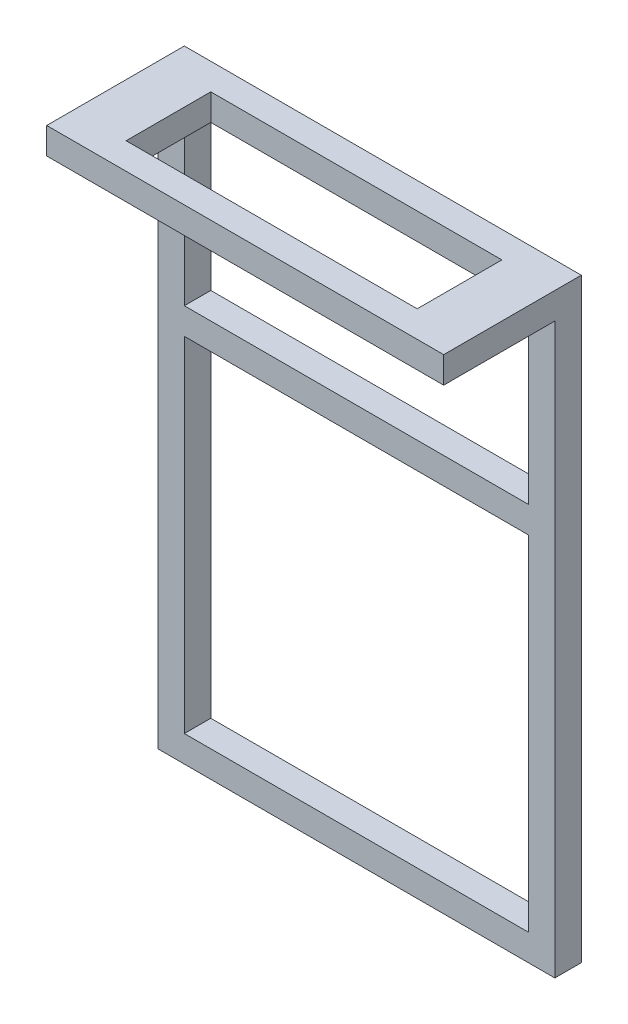
ISO-10303-21;
HEADER;
FILE_DESCRIPTION(('STEP AP214'),'2;1');
FILE_NAME('part.step','',(''),(''),'','','');
FILE_SCHEMA(('AUTOMOTIVE_DESIGN { 1 0 10303 214 1 1 1 1 }'));
ENDSEC;
DATA;
#1=APPLICATION_CONTEXT('core data for automotive mechanical design processes');
#2=APPLICATION_PROTOCOL_DEFINITION('international standard','automotive_design',2000,#1);
#3=PRODUCT_CONTEXT('',#1,'mechanical');
#4=PRODUCT('Part','Part','',(#3));
#5=PRODUCT_RELATED_PRODUCT_CATEGORY('part','',(#4));
#6=PRODUCT_DEFINITION_FORMATION('','',#4);
#7=PRODUCT_DEFINITION_CONTEXT('part definition',#1,'design');
#8=PRODUCT_DEFINITION('design','',#6,#7);
#9=PRODUCT_DEFINITION_SHAPE('','',#8);
#10=(LENGTH_UNIT() NAMED_UNIT(*) SI_UNIT(.MILLI.,.METRE.));
#11=(NAMED_UNIT(*) PLANE_ANGLE_UNIT() SI_UNIT($,.RADIAN.));
#12=(NAMED_UNIT(*) SI_UNIT($,.STERADIAN.) SOLID_ANGLE_UNIT());
#13=UNCERTAINTY_MEASURE_WITH_UNIT(LENGTH_MEASURE(1.E-05),#10,'distance_accuracy_value','');
#14=(GEOMETRIC_REPRESENTATION_CONTEXT(3) GLOBAL_UNCERTAINTY_ASSIGNED_CONTEXT((#13)) GLOBAL_UNIT_ASSIGNED_CONTEXT((#10,
#11,#12)) REPRESENTATION_CONTEXT('',''));
#15=CARTESIAN_POINT('',(0.,0.,0.));
#16=DIRECTION('',(0.,0.,1.));
#17=DIRECTION('',(1.,0.,0.));
#18=AXIS2_PLACEMENT_3D('',#15,#16,#17);
#19=CARTESIAN_POINT('',(4.,0.,2.));
#20=DIRECTION('',(0.,0.,-1.));
#21=DIRECTION('',(-1.,0.,0.));
#22=AXIS2_PLACEMENT_3D('',#19,#20,#21);
#23=PLANE('',#22);
#24=DIRECTION('',(0.,1.,0.));
#25=VECTOR('',#24,1.);
#26=CARTESIAN_POINT('',(4.,0.,2.));
#27=LINE('',#26,#25);
#28=CARTESIAN_POINT('',(4.,0.,2.));
#29=VERTEX_POINT('',#28);
#30=CARTESIAN_POINT('',(4.,2.,2.));
#31=VERTEX_POINT('',#30);
#32=EDGE_CURVE('E292',#29,#31,#27,.T.);
#33=ORIENTED_EDGE('',*,*,#32,.F.);
#34=DIRECTION('',(1.,0.,0.));
#35=VECTOR('',#34,1.);
#36=CARTESIAN_POINT('',(4.,0.,2.));
#37=LINE('',#36,#35);
#38=CARTESIAN_POINT('',(26.,0.,2.));
#39=VERTEX_POINT('',#38);
#40=EDGE_CURVE('E194',#29,#39,#37,.T.);
#41=ORIENTED_EDGE('',*,*,#40,.T.);
#42=DIRECTION('',(0.,1.,0.));
#43=VECTOR('',#42,1.);
#44=CARTESIAN_POINT('',(26.,0.,2.));
#45=LINE('',#44,#43);
#46=CARTESIAN_POINT('',(26.,2.,2.));
#47=VERTEX_POINT('',#46);
#48=EDGE_CURVE('E296',#39,#47,#45,.T.);
#49=ORIENTED_EDGE('',*,*,#48,.T.);
#50=DIRECTION('',(-1.,0.,0.));
#51=VECTOR('',#50,1.);
#52=CARTESIAN_POINT('',(4.,2.,2.));
#53=LINE('',#52,#51);
#54=EDGE_CURVE('E269',#47,#31,#53,.T.);
#55=ORIENTED_EDGE('',*,*,#54,.T.);
#56=EDGE_LOOP('',(#33,#41,#49,#55));
#57=FACE_BOUND('',#56,.T.);
#58=ADVANCED_FACE('F39',(#57),#23,.F.);
#59=CARTESIAN_POINT('',(0.,2.,0.));
#60=DIRECTION('',(0.,0.,1.));
#61=DIRECTION('',(1.,0.,0.));
#62=AXIS2_PLACEMENT_3D('',#59,#60,#61);
#63=PLANE('',#62);
#64=DIRECTION('',(-1.,0.,0.));
#65=VECTOR('',#64,1.);
#66=CARTESIAN_POINT('',(28.,-13.,0.));
#67=LINE('',#66,#65);
#68=CARTESIAN_POINT('',(28.,-13.,0.));
#69=VERTEX_POINT('',#68);
#70=CARTESIAN_POINT('',(2.,-13.,0.));
#71=VERTEX_POINT('',#70);
#72=EDGE_CURVE('E176',#69,#71,#67,.T.);
#73=ORIENTED_EDGE('',*,*,#72,.F.);
#74=DIRECTION('',(0.,-1.,0.));
#75=VECTOR('',#74,1.);
#76=CARTESIAN_POINT('',(28.,0.,0.));
#77=LINE('',#76,#75);
#78=CARTESIAN_POINT('',(28.,0.,0.));
#79=VERTEX_POINT('',#78);
#80=EDGE_CURVE('E55',#79,#69,#77,.T.);
#81=ORIENTED_EDGE('',*,*,#80,.F.);
#82=DIRECTION('',(1.,0.,0.));
#83=VECTOR('',#82,1.);
#84=CARTESIAN_POINT('',(28.,0.,0.));
#85=LINE('',#84,#83);
#86=CARTESIAN_POINT('',(2.,0.,0.));
#87=VERTEX_POINT('',#86);
#88=EDGE_CURVE('E184',#87,#79,#85,.T.);
#89=ORIENTED_EDGE('',*,*,#88,.F.);
#90=DIRECTION('',(0.,1.,0.));
#91=VECTOR('',#90,1.);
#92=CARTESIAN_POINT('',(2.,0.,0.));
#93=LINE('',#92,#91);
#94=EDGE_CURVE('E167',#71,#87,#93,.T.);
#95=ORIENTED_EDGE('',*,*,#94,.F.);
#96=EDGE_LOOP('',(#73,#81,#89,#95));
#97=FACE_BOUND('',#96,.T.);
#98=DIRECTION('',(0.,-1.,0.));
#99=VECTOR('',#98,1.);
#100=CARTESIAN_POINT('',(30.,2.,0.));
#101=LINE('',#100,#99);
#102=CARTESIAN_POINT('',(30.,2.,0.));
#103=VERTEX_POINT('',#102);
#104=CARTESIAN_POINT('',(30.,-43.,0.));
#105=VERTEX_POINT('',#104);
#106=EDGE_CURVE('E329',#103,#105,#101,.T.);
#107=ORIENTED_EDGE('',*,*,#106,.T.);
#108=DIRECTION('',(-1.,0.,0.));
#109=VECTOR('',#108,1.);
#110=CARTESIAN_POINT('',(0.,-43.,0.));
#111=LINE('',#110,#109);
#112=CARTESIAN_POINT('',(0.,-43.,0.));
#113=VERTEX_POINT('',#112);
#114=EDGE_CURVE('E248',#105,#113,#111,.T.);
#115=ORIENTED_EDGE('',*,*,#114,.T.);
#116=DIRECTION('',(0.,-1.,0.));
#117=VECTOR('',#116,1.);
#118=CARTESIAN_POINT('',(0.,2.,0.));
#119=LINE('',#118,#117);
#120=CARTESIAN_POINT('',(0.,2.,0.));
#121=VERTEX_POINT('',#120);
#122=EDGE_CURVE('E318',#121,#113,#119,.T.);
#123=ORIENTED_EDGE('',*,*,#122,.F.);
#124=DIRECTION('',(-1.,0.,0.));
#125=VECTOR('',#124,1.);
#126=CARTESIAN_POINT('',(0.,2.,0.));
#127=LINE('',#126,#125);
#128=EDGE_CURVE('E315',#103,#121,#127,.T.);
#129=ORIENTED_EDGE('',*,*,#128,.F.);
#130=EDGE_LOOP('',(#107,#115,#123,#129));
#131=FACE_BOUND('',#130,.T.);
#132=DIRECTION('',(-1.,0.,0.));
#133=VECTOR('',#132,1.);
#134=CARTESIAN_POINT('',(0.,-15.,0.));
#135=LINE('',#134,#133);
#136=CARTESIAN_POINT('',(28.,-15.,0.));
#137=VERTEX_POINT('',#136);
#138=CARTESIAN_POINT('',(2.,-15.,0.));
#139=VERTEX_POINT('',#138);
#140=EDGE_CURVE('E207',#137,#139,#135,.T.);
#141=ORIENTED_EDGE('',*,*,#140,.T.);
#142=DIRECTION('',(0.,-1.,0.));
#143=VECTOR('',#142,1.);
#144=CARTESIAN_POINT('',(2.,0.,0.));
#145=LINE('',#144,#143);
#146=CARTESIAN_POINT('',(2.,-41.,0.));
#147=VERTEX_POINT('',#146);
#148=EDGE_CURVE('E219',#139,#147,#145,.T.);
#149=ORIENTED_EDGE('',*,*,#148,.T.);
#150=DIRECTION('',(-1.,0.,0.));
#151=VECTOR('',#150,1.);
#152=CARTESIAN_POINT('',(0.,-41.,0.));
#153=LINE('',#152,#151);
#154=CARTESIAN_POINT('',(28.,-41.,0.));
#155=VERTEX_POINT('',#154);
#156=EDGE_CURVE('E215',#155,#147,#153,.T.);
#157=ORIENTED_EDGE('',*,*,#156,.F.);
#158=DIRECTION('',(0.,-1.,0.));
#159=VECTOR('',#158,1.);
#160=CARTESIAN_POINT('',(28.,0.,0.));
#161=LINE('',#160,#159);
#162=EDGE_CURVE('E211',#137,#155,#161,.T.);
#163=ORIENTED_EDGE('',*,*,#162,.F.);
#164=EDGE_LOOP('',(#141,#149,#157,#163));
#165=FACE_BOUND('',#164,.T.);
#166=ADVANCED_FACE('F181',(#97,#131,#165),#63,.F.);
#167=DIRECTION('',(1.,0.,0.));
#168=VECTOR('',#167,1.);
#169=CARTESIAN_POINT('',(0.,0.,2.));
#170=LINE('',#169,#168);
#171=CARTESIAN_POINT('',(28.,0.,2.));
#172=VERTEX_POINT('',#171);
#173=CARTESIAN_POINT('',(30.,0.,2.));
#174=VERTEX_POINT('',#173);
#175=EDGE_CURVE('E257',#172,#174,#170,.T.);
#176=ORIENTED_EDGE('',*,*,#175,.F.);
#177=DIRECTION('',(0.,-1.,0.));
#178=VECTOR('',#177,1.);
#179=CARTESIAN_POINT('',(28.,0.,2.));
#180=LINE('',#179,#178);
#181=CARTESIAN_POINT('',(28.,-13.,2.));
#182=VERTEX_POINT('',#181);
#183=EDGE_CURVE('E203',#172,#182,#180,.T.);
#184=ORIENTED_EDGE('',*,*,#183,.T.);
#185=DIRECTION('',(-1.,0.,0.));
#186=VECTOR('',#185,1.);
#187=CARTESIAN_POINT('',(4.,-13.,2.));
#188=LINE('',#187,#186);
#189=CARTESIAN_POINT('',(2.,-13.,2.));
#190=VERTEX_POINT('',#189);
#191=EDGE_CURVE('E11',#182,#190,#188,.T.);
#192=ORIENTED_EDGE('',*,*,#191,.T.);
#193=DIRECTION('',(0.,1.,0.));
#194=VECTOR('',#193,1.);
#195=CARTESIAN_POINT('',(2.,0.,2.));
#196=LINE('',#195,#194);
#197=CARTESIAN_POINT('',(2.,0.,2.));
#198=VERTEX_POINT('',#197);
#199=EDGE_CURVE('E170',#190,#198,#196,.T.);
#200=ORIENTED_EDGE('',*,*,#199,.T.);
#201=CARTESIAN_POINT('',(0.,0.,2.));
#202=VERTEX_POINT('',#201);
#203=EDGE_CURVE('E263',#202,#198,#170,.T.);
#204=ORIENTED_EDGE('',*,*,#203,.F.);
#205=DIRECTION('',(0.,1.,0.));
#206=VECTOR('',#205,1.);
#207=CARTESIAN_POINT('',(0.,-43.,2.));
#208=LINE('',#207,#206);
#209=CARTESIAN_POINT('',(0.,-43.,2.));
#210=VERTEX_POINT('',#209);
#211=EDGE_CURVE('E252',#210,#202,#208,.T.);
#212=ORIENTED_EDGE('',*,*,#211,.F.);
#213=DIRECTION('',(1.,0.,0.));
#214=VECTOR('',#213,1.);
#215=CARTESIAN_POINT('',(0.,-43.,2.));
#216=LINE('',#215,#214);
#217=CARTESIAN_POINT('',(30.,-43.,2.));
#218=VERTEX_POINT('',#217);
#219=EDGE_CURVE('E240',#210,#218,#216,.T.);
#220=ORIENTED_EDGE('',*,*,#219,.T.);
#221=DIRECTION('',(0.,1.,0.));
#222=VECTOR('',#221,1.);
#223=CARTESIAN_POINT('',(30.,-43.,2.));
#224=LINE('',#223,#222);
#225=EDGE_CURVE('E253',#218,#174,#224,.T.);
#226=ORIENTED_EDGE('',*,*,#225,.T.);
#227=EDGE_LOOP('',(#176,#184,#192,#200,#204,#212,#220,#226));
#228=FACE_BOUND('',#227,.T.);
#229=DIRECTION('',(-1.,0.,0.));
#230=VECTOR('',#229,1.);
#231=CARTESIAN_POINT('',(4.,-15.,2.));
#232=LINE('',#231,#230);
#233=CARTESIAN_POINT('',(28.,-15.,2.));
#234=VERTEX_POINT('',#233);
#235=CARTESIAN_POINT('',(2.,-15.,2.));
#236=VERTEX_POINT('',#235);
#237=EDGE_CURVE('E48',#234,#236,#232,.T.);
#238=ORIENTED_EDGE('',*,*,#237,.F.);
#239=DIRECTION('',(0.,-1.,0.));
#240=VECTOR('',#239,1.);
#241=CARTESIAN_POINT('',(28.,0.,2.));
#242=LINE('',#241,#240);
#243=CARTESIAN_POINT('',(28.,-41.,2.));
#244=VERTEX_POINT('',#243);
#245=EDGE_CURVE('E340',#234,#244,#242,.T.);
#246=ORIENTED_EDGE('',*,*,#245,.T.);
#247=DIRECTION('',(-1.,0.,0.));
#248=VECTOR('',#247,1.);
#249=CARTESIAN_POINT('',(4.,-41.,2.));
#250=LINE('',#249,#248);
#251=CARTESIAN_POINT('',(2.,-41.,2.));
#252=VERTEX_POINT('',#251);
#253=EDGE_CURVE('E344',#244,#252,#250,.T.);
#254=ORIENTED_EDGE('',*,*,#253,.T.);
#255=DIRECTION('',(0.,-1.,0.));
#256=VECTOR('',#255,1.);
#257=CARTESIAN_POINT('',(2.,0.,2.));
#258=LINE('',#257,#256);
#259=EDGE_CURVE('E348',#236,#252,#258,.T.);
#260=ORIENTED_EDGE('',*,*,#259,.F.);
#261=EDGE_LOOP('',(#238,#246,#254,#260));
#262=FACE_BOUND('',#261,.T.);
#263=ADVANCED_FACE('F362',(#228,#262),#23,.F.);
#264=CARTESIAN_POINT('',(0.,2.,0.));
#265=DIRECTION('',(1.,0.,0.));
#266=DIRECTION('',(0.,0.,-1.));
#267=AXIS2_PLACEMENT_3D('',#264,#265,#266);
#268=PLANE('',#267);
#269=DIRECTION('',(0.,-1.,0.));
#270=VECTOR('',#269,1.);
#271=CARTESIAN_POINT('',(0.,2.,10.4));
#272=LINE('',#271,#270);
#273=CARTESIAN_POINT('',(0.,2.,10.4));
#274=VERTEX_POINT('',#273);
#275=CARTESIAN_POINT('',(0.,0.,10.4));
#276=VERTEX_POINT('',#275);
#277=EDGE_CURVE('E336',#274,#276,#272,.T.);
#278=ORIENTED_EDGE('',*,*,#277,.F.);
#279=DIRECTION('',(0.,0.,1.));
#280=VECTOR('',#279,1.);
#281=CARTESIAN_POINT('',(0.,2.,0.));
#282=LINE('',#281,#280);
#283=EDGE_CURVE('E305',#121,#274,#282,.T.);
#284=ORIENTED_EDGE('',*,*,#283,.F.);
#285=ORIENTED_EDGE('',*,*,#122,.T.);
#286=DIRECTION('',(0.,0.,1.));
#287=VECTOR('',#286,1.);
#288=CARTESIAN_POINT('',(0.,-43.,0.));
#289=LINE('',#288,#287);
#290=EDGE_CURVE('E227',#113,#210,#289,.T.);
#291=ORIENTED_EDGE('',*,*,#290,.T.);
#292=ORIENTED_EDGE('',*,*,#211,.T.);
#293=DIRECTION('',(0.,0.,1.));
#294=VECTOR('',#293,1.);
#295=CARTESIAN_POINT('',(0.,0.,0.));
#296=LINE('',#295,#294);
#297=EDGE_CURVE('E295',#202,#276,#296,.T.);
#298=ORIENTED_EDGE('',*,*,#297,.T.);
#299=EDGE_LOOP('',(#278,#284,#285,#291,#292,#298));
#300=FACE_BOUND('',#299,.T.);
#301=ADVANCED_FACE('F41',(#300),#268,.F.);
#302=CARTESIAN_POINT('',(0.,2.,10.4));
#303=DIRECTION('',(0.,0.,-1.));
#304=DIRECTION('',(-1.,0.,0.));
#305=AXIS2_PLACEMENT_3D('',#302,#303,#304);
#306=PLANE('',#305);
#307=DIRECTION('',(1.,0.,0.));
#308=VECTOR('',#307,1.);
#309=CARTESIAN_POINT('',(0.,0.,10.4));
#310=LINE('',#309,#308);
#311=CARTESIAN_POINT('',(30.,0.,10.4));
#312=VERTEX_POINT('',#311);
#313=EDGE_CURVE('E321',#276,#312,#310,.T.);
#314=ORIENTED_EDGE('',*,*,#313,.T.);
#315=DIRECTION('',(0.,-1.,0.));
#316=VECTOR('',#315,1.);
#317=CARTESIAN_POINT('',(30.,2.,10.4));
#318=LINE('',#317,#316);
#319=CARTESIAN_POINT('',(30.,2.,10.4));
#320=VERTEX_POINT('',#319);
#321=EDGE_CURVE('E332',#320,#312,#318,.T.);
#322=ORIENTED_EDGE('',*,*,#321,.F.);
#323=DIRECTION('',(1.,0.,0.));
#324=VECTOR('',#323,1.);
#325=CARTESIAN_POINT('',(0.,2.,10.4));
#326=LINE('',#325,#324);
#327=EDGE_CURVE('E308',#274,#320,#326,.T.);
#328=ORIENTED_EDGE('',*,*,#327,.F.);
#329=ORIENTED_EDGE('',*,*,#277,.T.);
#330=EDGE_LOOP('',(#314,#322,#328,#329));
#331=FACE_BOUND('',#330,.T.);
#332=ADVANCED_FACE('F396',(#331),#306,.F.);
#333=CARTESIAN_POINT('',(30.,2.,0.));
#334=DIRECTION('',(-1.,0.,0.));
#335=DIRECTION('',(0.,0.,1.));
#336=AXIS2_PLACEMENT_3D('',#333,#334,#335);
#337=PLANE('',#336);
#338=DIRECTION('',(0.,0.,-1.));
#339=VECTOR('',#338,1.);
#340=CARTESIAN_POINT('',(30.,0.,0.));
#341=LINE('',#340,#339);
#342=EDGE_CURVE('E309',#312,#174,#341,.T.);
#343=ORIENTED_EDGE('',*,*,#342,.T.);
#344=ORIENTED_EDGE('',*,*,#225,.F.);
#345=DIRECTION('',(0.,0.,-1.));
#346=VECTOR('',#345,1.);
#347=CARTESIAN_POINT('',(30.,-43.,0.));
#348=LINE('',#347,#346);
#349=EDGE_CURVE('E244',#218,#105,#348,.T.);
#350=ORIENTED_EDGE('',*,*,#349,.T.);
#351=ORIENTED_EDGE('',*,*,#106,.F.);
#352=DIRECTION('',(0.,0.,-1.));
#353=VECTOR('',#352,1.);
#354=CARTESIAN_POINT('',(30.,2.,0.));
#355=LINE('',#354,#353);
#356=EDGE_CURVE('E312',#320,#103,#355,.T.);
#357=ORIENTED_EDGE('',*,*,#356,.F.);
#358=ORIENTED_EDGE('',*,*,#321,.T.);
#359=EDGE_LOOP('',(#343,#344,#350,#351,#357,#358));
#360=FACE_BOUND('',#359,.T.);
#361=ADVANCED_FACE('F438',(#360),#337,.F.);
#362=CARTESIAN_POINT('',(0.,2.,0.));
#363=DIRECTION('',(0.,1.,0.));
#364=DIRECTION('',(0.,0.,1.));
#365=AXIS2_PLACEMENT_3D('',#362,#363,#364);
#366=PLANE('',#365);
#367=DIRECTION('',(0.,0.,1.));
#368=VECTOR('',#367,1.);
#369=CARTESIAN_POINT('',(4.,2.,2.));
#370=LINE('',#369,#368);
#371=CARTESIAN_POINT('',(4.,2.,8.4));
#372=VERTEX_POINT('',#371);
#373=EDGE_CURVE('E278',#31,#372,#370,.T.);
#374=ORIENTED_EDGE('',*,*,#373,.F.);
#375=ORIENTED_EDGE('',*,*,#54,.F.);
#376=DIRECTION('',(0.,0.,-1.));
#377=VECTOR('',#376,1.);
#378=CARTESIAN_POINT('',(26.,2.,2.));
#379=LINE('',#378,#377);
#380=CARTESIAN_POINT('',(26.,2.,8.4));
#381=VERTEX_POINT('',#380);
#382=EDGE_CURVE('E285',#381,#47,#379,.T.);
#383=ORIENTED_EDGE('',*,*,#382,.F.);
#384=DIRECTION('',(1.,0.,0.));
#385=VECTOR('',#384,1.);
#386=CARTESIAN_POINT('',(4.,2.,8.4));
#387=LINE('',#386,#385);
#388=EDGE_CURVE('E281',#372,#381,#387,.T.);
#389=ORIENTED_EDGE('',*,*,#388,.F.);
#390=EDGE_LOOP('',(#374,#375,#383,#389));
#391=FACE_BOUND('',#390,.T.);
#392=ORIENTED_EDGE('',*,*,#283,.T.);
#393=ORIENTED_EDGE('',*,*,#327,.T.);
#394=ORIENTED_EDGE('',*,*,#356,.T.);
#395=ORIENTED_EDGE('',*,*,#128,.T.);
#396=EDGE_LOOP('',(#392,#393,#394,#395));
#397=FACE_BOUND('',#396,.T.);
#398=ADVANCED_FACE('F445',(#391,#397),#366,.T.);
#399=CARTESIAN_POINT('',(0.,0.,0.));
#400=DIRECTION('',(0.,1.,0.));
#401=DIRECTION('',(0.,0.,1.));
#402=AXIS2_PLACEMENT_3D('',#399,#400,#401);
#403=PLANE('',#402);
#404=ORIENTED_EDGE('',*,*,#40,.F.);
#405=DIRECTION('',(0.,0.,1.));
#406=VECTOR('',#405,1.);
#407=CARTESIAN_POINT('',(4.,0.,2.));
#408=LINE('',#407,#406);
#409=CARTESIAN_POINT('',(4.,0.,8.4));
#410=VERTEX_POINT('',#409);
#411=EDGE_CURVE('E264',#29,#410,#408,.T.);
#412=ORIENTED_EDGE('',*,*,#411,.T.);
#413=DIRECTION('',(1.,0.,0.));
#414=VECTOR('',#413,1.);
#415=CARTESIAN_POINT('',(4.,0.,8.4));
#416=LINE('',#415,#414);
#417=CARTESIAN_POINT('',(26.,0.,8.4));
#418=VERTEX_POINT('',#417);
#419=EDGE_CURVE('E268',#410,#418,#416,.T.);
#420=ORIENTED_EDGE('',*,*,#419,.T.);
#421=DIRECTION('',(0.,0.,-1.));
#422=VECTOR('',#421,1.);
#423=CARTESIAN_POINT('',(26.,0.,2.));
#424=LINE('',#423,#422);
#425=EDGE_CURVE('E273',#418,#39,#424,.T.);
#426=ORIENTED_EDGE('',*,*,#425,.T.);
#427=EDGE_LOOP('',(#404,#412,#420,#426));
#428=FACE_BOUND('',#427,.T.);
#429=ORIENTED_EDGE('',*,*,#203,.T.);
#430=DIRECTION('',(0.,0.,-1.));
#431=VECTOR('',#430,1.);
#432=CARTESIAN_POINT('',(2.,0.,10.4));
#433=LINE('',#432,#431);
#434=EDGE_CURVE('E172',#198,#87,#433,.T.);
#435=ORIENTED_EDGE('',*,*,#434,.T.);
#436=ORIENTED_EDGE('',*,*,#88,.T.);
#437=DIRECTION('',(0.,0.,-1.));
#438=VECTOR('',#437,1.);
#439=CARTESIAN_POINT('',(28.,0.,10.4));
#440=LINE('',#439,#438);
#441=EDGE_CURVE('E191',#172,#79,#440,.T.);
#442=ORIENTED_EDGE('',*,*,#441,.F.);
#443=ORIENTED_EDGE('',*,*,#175,.T.);
#444=ORIENTED_EDGE('',*,*,#342,.F.);
#445=ORIENTED_EDGE('',*,*,#313,.F.);
#446=ORIENTED_EDGE('',*,*,#297,.F.);
#447=EDGE_LOOP('',(#429,#435,#436,#442,#443,#444,#445,#446));
#448=FACE_BOUND('',#447,.T.);
#449=ADVANCED_FACE('F403',(#428,#448),#403,.F.);
#450=CARTESIAN_POINT('',(4.,0.,2.));
#451=DIRECTION('',(-1.,0.,0.));
#452=DIRECTION('',(0.,0.,1.));
#453=AXIS2_PLACEMENT_3D('',#450,#451,#452);
#454=PLANE('',#453);
#455=ORIENTED_EDGE('',*,*,#373,.T.);
#456=DIRECTION('',(0.,1.,0.));
#457=VECTOR('',#456,1.);
#458=CARTESIAN_POINT('',(4.,0.,8.4));
#459=LINE('',#458,#457);
#460=EDGE_CURVE('E277',#410,#372,#459,.T.);
#461=ORIENTED_EDGE('',*,*,#460,.F.);
#462=ORIENTED_EDGE('',*,*,#411,.F.);
#463=ORIENTED_EDGE('',*,*,#32,.T.);
#464=EDGE_LOOP('',(#455,#461,#462,#463));
#465=FACE_BOUND('',#464,.T.);
#466=ADVANCED_FACE('F453',(#465),#454,.F.);
#467=CARTESIAN_POINT('',(26.,0.,2.));
#468=DIRECTION('',(1.,0.,0.));
#469=DIRECTION('',(0.,0.,-1.));
#470=AXIS2_PLACEMENT_3D('',#467,#468,#469);
#471=PLANE('',#470);
#472=ORIENTED_EDGE('',*,*,#382,.T.);
#473=ORIENTED_EDGE('',*,*,#48,.F.);
#474=ORIENTED_EDGE('',*,*,#425,.F.);
#475=DIRECTION('',(0.,1.,0.));
#476=VECTOR('',#475,1.);
#477=CARTESIAN_POINT('',(26.,0.,8.4));
#478=LINE('',#477,#476);
#479=EDGE_CURVE('E299',#418,#381,#478,.T.);
#480=ORIENTED_EDGE('',*,*,#479,.T.);
#481=EDGE_LOOP('',(#472,#473,#474,#480));
#482=FACE_BOUND('',#481,.T.);
#483=ADVANCED_FACE('F425',(#482),#471,.F.);
#484=CARTESIAN_POINT('',(4.,0.,8.4));
#485=DIRECTION('',(0.,0.,1.));
#486=DIRECTION('',(1.,0.,0.));
#487=AXIS2_PLACEMENT_3D('',#484,#485,#486);
#488=PLANE('',#487);
#489=ORIENTED_EDGE('',*,*,#388,.T.);
#490=ORIENTED_EDGE('',*,*,#479,.F.);
#491=ORIENTED_EDGE('',*,*,#419,.F.);
#492=ORIENTED_EDGE('',*,*,#460,.T.);
#493=EDGE_LOOP('',(#489,#490,#491,#492));
#494=FACE_BOUND('',#493,.T.);
#495=ADVANCED_FACE('F420',(#494),#488,.F.);
#496=CARTESIAN_POINT('',(0.,-43.,0.));
#497=DIRECTION('',(0.,1.,0.));
#498=DIRECTION('',(0.,0.,1.));
#499=AXIS2_PLACEMENT_3D('',#496,#497,#498);
#500=PLANE('',#499);
#501=ORIENTED_EDGE('',*,*,#290,.F.);
#502=ORIENTED_EDGE('',*,*,#114,.F.);
#503=ORIENTED_EDGE('',*,*,#349,.F.);
#504=ORIENTED_EDGE('',*,*,#219,.F.);
#505=EDGE_LOOP('',(#501,#502,#503,#504));
#506=FACE_BOUND('',#505,.T.);
#507=ADVANCED_FACE('F416',(#506),#500,.F.);
#508=CARTESIAN_POINT('',(0.,-15.,10.4));
#509=DIRECTION('',(0.,-1.,0.));
#510=DIRECTION('',(0.,0.,-1.));
#511=AXIS2_PLACEMENT_3D('',#508,#509,#510);
#512=PLANE('',#511);
#513=ORIENTED_EDGE('',*,*,#237,.T.);
#514=DIRECTION('',(0.,0.,-1.));
#515=VECTOR('',#514,1.);
#516=CARTESIAN_POINT('',(2.,-15.,10.4));
#517=LINE('',#516,#515);
#518=EDGE_CURVE('E224',#236,#139,#517,.T.);
#519=ORIENTED_EDGE('',*,*,#518,.T.);
#520=ORIENTED_EDGE('',*,*,#140,.F.);
#521=DIRECTION('',(0.,0.,-1.));
#522=VECTOR('',#521,1.);
#523=CARTESIAN_POINT('',(28.,-15.,10.4));
#524=LINE('',#523,#522);
#525=EDGE_CURVE('E223',#234,#137,#524,.T.);
#526=ORIENTED_EDGE('',*,*,#525,.F.);
#527=EDGE_LOOP('',(#513,#519,#520,#526));
#528=FACE_BOUND('',#527,.T.);
#529=ADVANCED_FACE('F355',(#528),#512,.T.);
#530=CARTESIAN_POINT('',(2.,0.,10.4));
#531=DIRECTION('',(1.,0.,0.));
#532=DIRECTION('',(0.,1.,0.));
#533=AXIS2_PLACEMENT_3D('',#530,#531,#532);
#534=PLANE('',#533);
#535=ORIENTED_EDGE('',*,*,#259,.T.);
#536=DIRECTION('',(0.,0.,-1.));
#537=VECTOR('',#536,1.);
#538=CARTESIAN_POINT('',(2.,-41.,10.4));
#539=LINE('',#538,#537);
#540=EDGE_CURVE('E228',#252,#147,#539,.T.);
#541=ORIENTED_EDGE('',*,*,#540,.T.);
#542=ORIENTED_EDGE('',*,*,#148,.F.);
#543=ORIENTED_EDGE('',*,*,#518,.F.);
#544=EDGE_LOOP('',(#535,#541,#542,#543));
#545=FACE_BOUND('',#544,.T.);
#546=ADVANCED_FACE('F360',(#545),#534,.T.);
#547=CARTESIAN_POINT('',(0.,-41.,10.4));
#548=DIRECTION('',(0.,-1.,0.));
#549=DIRECTION('',(0.,0.,-1.));
#550=AXIS2_PLACEMENT_3D('',#547,#548,#549);
#551=PLANE('',#550);
#552=DIRECTION('',(0.,0.,-1.));
#553=VECTOR('',#552,1.);
#554=CARTESIAN_POINT('',(28.,-41.,10.4));
#555=LINE('',#554,#553);
#556=EDGE_CURVE('E231',#244,#155,#555,.T.);
#557=ORIENTED_EDGE('',*,*,#556,.T.);
#558=ORIENTED_EDGE('',*,*,#156,.T.);
#559=ORIENTED_EDGE('',*,*,#540,.F.);
#560=ORIENTED_EDGE('',*,*,#253,.F.);
#561=EDGE_LOOP('',(#557,#558,#559,#560));
#562=FACE_BOUND('',#561,.T.);
#563=ADVANCED_FACE('F365',(#562),#551,.F.);
#564=CARTESIAN_POINT('',(28.,0.,10.4));
#565=DIRECTION('',(1.,0.,0.));
#566=DIRECTION('',(0.,1.,0.));
#567=AXIS2_PLACEMENT_3D('',#564,#565,#566);
#568=PLANE('',#567);
#569=ORIENTED_EDGE('',*,*,#525,.T.);
#570=ORIENTED_EDGE('',*,*,#162,.T.);
#571=ORIENTED_EDGE('',*,*,#556,.F.);
#572=ORIENTED_EDGE('',*,*,#245,.F.);
#573=EDGE_LOOP('',(#569,#570,#571,#572));
#574=FACE_BOUND('',#573,.T.);
#575=ADVANCED_FACE('F370',(#574),#568,.F.);
#576=CARTESIAN_POINT('',(28.,-13.,10.4));
#577=DIRECTION('',(0.,-1.,0.));
#578=DIRECTION('',(0.,0.,-1.));
#579=AXIS2_PLACEMENT_3D('',#576,#577,#578);
#580=PLANE('',#579);
#581=DIRECTION('',(0.,0.,-1.));
#582=VECTOR('',#581,1.);
#583=CARTESIAN_POINT('',(28.,-13.,10.4));
#584=LINE('',#583,#582);
#585=EDGE_CURVE('E173',#182,#69,#584,.T.);
#586=ORIENTED_EDGE('',*,*,#585,.T.);
#587=ORIENTED_EDGE('',*,*,#72,.T.);
#588=DIRECTION('',(0.,0.,-1.));
#589=VECTOR('',#588,1.);
#590=CARTESIAN_POINT('',(2.,-13.,10.4));
#591=LINE('',#590,#589);
#592=EDGE_CURVE('E63',#190,#71,#591,.T.);
#593=ORIENTED_EDGE('',*,*,#592,.F.);
#594=ORIENTED_EDGE('',*,*,#191,.F.);
#595=EDGE_LOOP('',(#586,#587,#593,#594));
#596=FACE_BOUND('',#595,.T.);
#597=ADVANCED_FACE('F177',(#596),#580,.F.);
#598=CARTESIAN_POINT('',(28.,0.,10.4));
#599=DIRECTION('',(1.,0.,0.));
#600=DIRECTION('',(0.,0.,-1.));
#601=AXIS2_PLACEMENT_3D('',#598,#599,#600);
#602=PLANE('',#601);
#603=ORIENTED_EDGE('',*,*,#441,.T.);
#604=ORIENTED_EDGE('',*,*,#80,.T.);
#605=ORIENTED_EDGE('',*,*,#585,.F.);
#606=ORIENTED_EDGE('',*,*,#183,.F.);
#607=EDGE_LOOP('',(#603,#604,#605,#606));
#608=FACE_BOUND('',#607,.T.);
#609=ADVANCED_FACE('F377',(#608),#602,.F.);
#610=CARTESIAN_POINT('',(2.,0.,10.4));
#611=DIRECTION('',(-1.,0.,0.));
#612=DIRECTION('',(0.,-1.,0.));
#613=AXIS2_PLACEMENT_3D('',#610,#611,#612);
#614=PLANE('',#613);
#615=ORIENTED_EDGE('',*,*,#592,.T.);
#616=ORIENTED_EDGE('',*,*,#94,.T.);
#617=ORIENTED_EDGE('',*,*,#434,.F.);
#618=ORIENTED_EDGE('',*,*,#199,.F.);
#619=EDGE_LOOP('',(#615,#616,#617,#618));
#620=FACE_BOUND('',#619,.T.);
#621=ADVANCED_FACE('F165',(#620),#614,.F.);
#622=CLOSED_SHELL('',(#58,#166,#263,#301,#332,#361,#398,#449,#466,#483,#495,#507,#529,#546,#563,
#575,#597,#609,#621));
#623=MANIFOLD_SOLID_BREP('B2',#622);
#624=ADVANCED_BREP_SHAPE_REPRESENTATION('',(#18,#623),#14);
#625=SHAPE_DEFINITION_REPRESENTATION(#9,#624);
ENDSEC;
END-ISO-10303-21;
